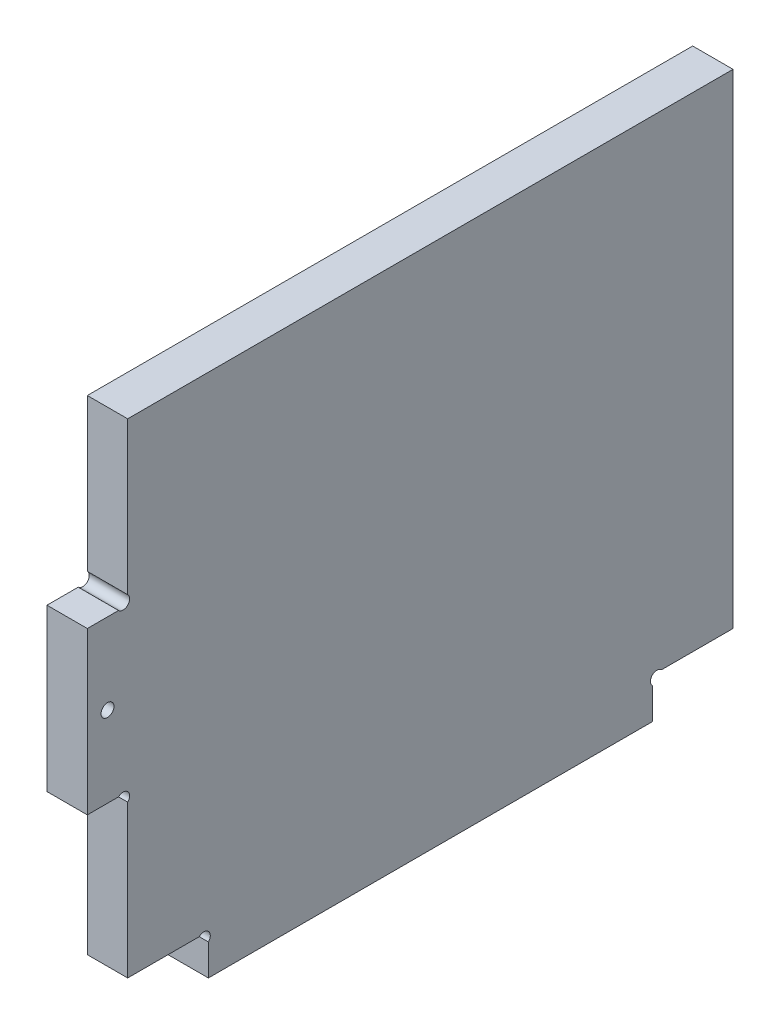
ISO-10303-21;
HEADER;
FILE_DESCRIPTION(('STEP AP214'),'2;1');
FILE_NAME('part.step','',(''),(''),'','','');
FILE_SCHEMA(('AUTOMOTIVE_DESIGN { 1 0 10303 214 1 1 1 1 }'));
ENDSEC;
DATA;
#1=APPLICATION_CONTEXT('core data for automotive mechanical design processes');
#2=APPLICATION_PROTOCOL_DEFINITION('international standard','automotive_design',2000,#1);
#3=PRODUCT_CONTEXT('',#1,'mechanical');
#4=PRODUCT('Part','Part','',(#3));
#5=PRODUCT_RELATED_PRODUCT_CATEGORY('part','',(#4));
#6=PRODUCT_DEFINITION_FORMATION('','',#4);
#7=PRODUCT_DEFINITION_CONTEXT('part definition',#1,'design');
#8=PRODUCT_DEFINITION('design','',#6,#7);
#9=PRODUCT_DEFINITION_SHAPE('','',#8);
#10=(LENGTH_UNIT() NAMED_UNIT(*) SI_UNIT(.MILLI.,.METRE.));
#11=(NAMED_UNIT(*) PLANE_ANGLE_UNIT() SI_UNIT($,.RADIAN.));
#12=(NAMED_UNIT(*) SI_UNIT($,.STERADIAN.) SOLID_ANGLE_UNIT());
#13=UNCERTAINTY_MEASURE_WITH_UNIT(LENGTH_MEASURE(1.E-05),#10,'distance_accuracy_value','');
#14=(GEOMETRIC_REPRESENTATION_CONTEXT(3) GLOBAL_UNCERTAINTY_ASSIGNED_CONTEXT((#13)) GLOBAL_UNIT_ASSIGNED_CONTEXT((#10,
#11,#12)) REPRESENTATION_CONTEXT('',''));
#15=CARTESIAN_POINT('',(0.,0.,0.));
#16=DIRECTION('',(0.,0.,1.));
#17=DIRECTION('',(1.,0.,0.));
#18=AXIS2_PLACEMENT_3D('',#15,#16,#17);
#19=CARTESIAN_POINT('',(10.,8.86862915010153,-141.131370849899));
#20=DIRECTION('',(1.,0.,0.));
#21=DIRECTION('',(0.,0.,-1.));
#22=AXIS2_PLACEMENT_3D('',#19,#20,#21);
#23=PLANE('',#22);
#24=CARTESIAN_POINT('',(10.,8.86862915010153,-141.131370849899));
#25=DIRECTION('',(-1.,0.,0.));
#26=DIRECTION('',(0.,0.,-1.));
#27=AXIS2_PLACEMENT_3D('',#24,#25,#26);
#28=CIRCLE('',#27,1.59999999999999);
#29=CARTESIAN_POINT('',(10.,7.73725830020309,-140.));
#30=VERTEX_POINT('',#29);
#31=CARTESIAN_POINT('',(10.,10.,-142.262741699797));
#32=VERTEX_POINT('',#31);
#33=EDGE_CURVE('E200',#30,#32,#28,.T.);
#34=ORIENTED_EDGE('',*,*,#33,.T.);
#35=DIRECTION('',(0.,0.,-1.));
#36=VECTOR('',#35,1.);
#37=CARTESIAN_POINT('',(10.,10.,-160.));
#38=LINE('',#37,#36);
#39=CARTESIAN_POINT('',(10.,10.,-160.));
#40=VERTEX_POINT('',#39);
#41=EDGE_CURVE('E161',#32,#40,#38,.T.);
#42=ORIENTED_EDGE('',*,*,#41,.T.);
#43=DIRECTION('',(0.,1.,0.));
#44=VECTOR('',#43,1.);
#45=CARTESIAN_POINT('',(10.,130.,-160.));
#46=LINE('',#45,#44);
#47=CARTESIAN_POINT('',(10.,130.,-160.));
#48=VERTEX_POINT('',#47);
#49=EDGE_CURVE('E203',#40,#48,#46,.T.);
#50=ORIENTED_EDGE('',*,*,#49,.T.);
#51=DIRECTION('',(0.,0.,1.));
#52=VECTOR('',#51,1.);
#53=CARTESIAN_POINT('',(10.,130.,-10.));
#54=LINE('',#53,#52);
#55=CARTESIAN_POINT('',(10.,130.,-10.));
#56=VERTEX_POINT('',#55);
#57=EDGE_CURVE('E205',#48,#56,#54,.T.);
#58=ORIENTED_EDGE('',*,*,#57,.T.);
#59=DIRECTION('',(0.,-1.,0.));
#60=VECTOR('',#59,1.);
#61=CARTESIAN_POINT('',(10.,92.262741699797,-10.));
#62=LINE('',#61,#60);
#63=CARTESIAN_POINT('',(10.,92.262741699797,-10.));
#64=VERTEX_POINT('',#63);
#65=EDGE_CURVE('E207',#56,#64,#62,.T.);
#66=ORIENTED_EDGE('',*,*,#65,.T.);
#67=CARTESIAN_POINT('',(10.,91.1313708498985,-8.86862915010154));
#68=DIRECTION('',(-1.,0.,0.));
#69=DIRECTION('',(0.,0.,1.));
#70=AXIS2_PLACEMENT_3D('',#67,#68,#69);
#71=CIRCLE('',#70,1.6);
#72=CARTESIAN_POINT('',(10.,90.,-7.73725830020305));
#73=VERTEX_POINT('',#72);
#74=EDGE_CURVE('E209',#64,#73,#71,.T.);
#75=ORIENTED_EDGE('',*,*,#74,.T.);
#76=DIRECTION('',(0.,0.,1.));
#77=VECTOR('',#76,1.);
#78=CARTESIAN_POINT('',(10.,90.,0.));
#79=LINE('',#78,#77);
#80=CARTESIAN_POINT('',(10.,90.,0.));
#81=VERTEX_POINT('',#80);
#82=EDGE_CURVE('E211',#73,#81,#79,.T.);
#83=ORIENTED_EDGE('',*,*,#82,.T.);
#84=DIRECTION('',(0.,-1.,0.));
#85=VECTOR('',#84,1.);
#86=CARTESIAN_POINT('',(10.,50.,0.));
#87=LINE('',#86,#85);
#88=CARTESIAN_POINT('',(10.,50.,0.));
#89=VERTEX_POINT('',#88);
#90=EDGE_CURVE('E213',#81,#89,#87,.T.);
#91=ORIENTED_EDGE('',*,*,#90,.T.);
#92=DIRECTION('',(0.,0.,-1.));
#93=VECTOR('',#92,1.);
#94=CARTESIAN_POINT('',(10.,50.,0.));
#95=LINE('',#94,#93);
#96=CARTESIAN_POINT('',(10.,50.,-7.73725830020305));
#97=VERTEX_POINT('',#96);
#98=EDGE_CURVE('E215',#89,#97,#95,.T.);
#99=ORIENTED_EDGE('',*,*,#98,.T.);
#100=CARTESIAN_POINT('',(10.,48.8686291501015,-8.86862915010154));
#101=DIRECTION('',(-1.,0.,0.));
#102=DIRECTION('',(0.,0.,-1.));
#103=AXIS2_PLACEMENT_3D('',#100,#101,#102);
#104=CIRCLE('',#103,1.6);
#105=CARTESIAN_POINT('',(10.,47.7372583002031,-10.));
#106=VERTEX_POINT('',#105);
#107=EDGE_CURVE('E217',#97,#106,#104,.T.);
#108=ORIENTED_EDGE('',*,*,#107,.T.);
#109=DIRECTION('',(0.,-1.,0.));
#110=VECTOR('',#109,1.);
#111=CARTESIAN_POINT('',(10.,10.,-10.));
#112=LINE('',#111,#110);
#113=CARTESIAN_POINT('',(10.,10.,-10.));
#114=VERTEX_POINT('',#113);
#115=EDGE_CURVE('E219',#106,#114,#112,.T.);
#116=ORIENTED_EDGE('',*,*,#115,.T.);
#117=DIRECTION('',(0.,0.,-1.));
#118=VECTOR('',#117,1.);
#119=CARTESIAN_POINT('',(10.,10.,-27.7372583002031));
#120=LINE('',#119,#118);
#121=CARTESIAN_POINT('',(10.,10.,-27.7372583002031));
#122=VERTEX_POINT('',#121);
#123=EDGE_CURVE('E221',#114,#122,#120,.T.);
#124=ORIENTED_EDGE('',*,*,#123,.T.);
#125=CARTESIAN_POINT('',(10.,8.86862915010153,-28.8686291501015));
#126=DIRECTION('',(-1.,0.,0.));
#127=DIRECTION('',(0.,0.,1.));
#128=AXIS2_PLACEMENT_3D('',#125,#126,#127);
#129=CIRCLE('',#128,1.59999999999999);
#130=CARTESIAN_POINT('',(10.,7.73725830020309,-30.));
#131=VERTEX_POINT('',#130);
#132=EDGE_CURVE('E223',#122,#131,#129,.T.);
#133=ORIENTED_EDGE('',*,*,#132,.T.);
#134=DIRECTION('',(0.,-1.,0.));
#135=VECTOR('',#134,1.);
#136=CARTESIAN_POINT('',(10.,7.73725830020309,-30.));
#137=LINE('',#136,#135);
#138=CARTESIAN_POINT('',(10.,0.,-30.));
#139=VERTEX_POINT('',#138);
#140=EDGE_CURVE('E225',#131,#139,#137,.T.);
#141=ORIENTED_EDGE('',*,*,#140,.T.);
#142=DIRECTION('',(0.,0.,-1.));
#143=VECTOR('',#142,1.);
#144=CARTESIAN_POINT('',(10.,0.,-30.));
#145=LINE('',#144,#143);
#146=CARTESIAN_POINT('',(10.,0.,-140.));
#147=VERTEX_POINT('',#146);
#148=EDGE_CURVE('E54',#139,#147,#145,.T.);
#149=ORIENTED_EDGE('',*,*,#148,.T.);
#150=DIRECTION('',(0.,1.,0.));
#151=VECTOR('',#150,1.);
#152=CARTESIAN_POINT('',(10.,7.73725830020309,-140.));
#153=LINE('',#152,#151);
#154=EDGE_CURVE('E49',#147,#30,#153,.T.);
#155=ORIENTED_EDGE('',*,*,#154,.T.);
#156=EDGE_LOOP('',(#34,#42,#50,#58,#66,#75,#83,#91,#99,#108,#116,#124,#133,#141,#149,#155));
#157=FACE_BOUND('',#156,.T.);
#158=CARTESIAN_POINT('',(10.,70.,-5.));
#159=DIRECTION('',(1.,0.,0.));
#160=DIRECTION('',(0.,0.,-1.));
#161=AXIS2_PLACEMENT_3D('',#158,#159,#160);
#162=CIRCLE('',#161,1.6);
#163=CARTESIAN_POINT('',(10.,70.,-6.6));
#164=VERTEX_POINT('',#163);
#165=EDGE_CURVE('E166',#164,#164,#162,.T.);
#166=ORIENTED_EDGE('',*,*,#165,.F.);
#167=EDGE_LOOP('',(#166));
#168=FACE_BOUND('',#167,.T.);
#169=ADVANCED_FACE('F34',(#157,#168),#23,.T.);
#170=CARTESIAN_POINT('',(0.,8.86862915010153,-141.131370849899));
#171=DIRECTION('',(1.,0.,0.));
#172=DIRECTION('',(0.,0.,-1.));
#173=AXIS2_PLACEMENT_3D('',#170,#171,#172);
#174=PLANE('',#173);
#175=CARTESIAN_POINT('',(0.,8.86862915010153,-141.131370849899));
#176=DIRECTION('',(-1.,0.,0.));
#177=DIRECTION('',(0.,0.,-1.));
#178=AXIS2_PLACEMENT_3D('',#175,#176,#177);
#179=CIRCLE('',#178,1.59999999999999);
#180=CARTESIAN_POINT('',(0.,7.73725830020309,-140.));
#181=VERTEX_POINT('',#180);
#182=CARTESIAN_POINT('',(0.,10.,-142.262741699797));
#183=VERTEX_POINT('',#182);
#184=EDGE_CURVE('E152',#181,#183,#179,.T.);
#185=ORIENTED_EDGE('',*,*,#184,.F.);
#186=DIRECTION('',(0.,1.,0.));
#187=VECTOR('',#186,1.);
#188=CARTESIAN_POINT('',(0.,7.73725830020309,-140.));
#189=LINE('',#188,#187);
#190=CARTESIAN_POINT('',(0.,0.,-140.));
#191=VERTEX_POINT('',#190);
#192=EDGE_CURVE('E198',#191,#181,#189,.T.);
#193=ORIENTED_EDGE('',*,*,#192,.F.);
#194=DIRECTION('',(0.,0.,-1.));
#195=VECTOR('',#194,1.);
#196=CARTESIAN_POINT('',(0.,0.,-30.));
#197=LINE('',#196,#195);
#198=CARTESIAN_POINT('',(0.,0.,-30.));
#199=VERTEX_POINT('',#198);
#200=EDGE_CURVE('E196',#199,#191,#197,.T.);
#201=ORIENTED_EDGE('',*,*,#200,.F.);
#202=DIRECTION('',(0.,-1.,0.));
#203=VECTOR('',#202,1.);
#204=CARTESIAN_POINT('',(0.,7.73725830020309,-30.));
#205=LINE('',#204,#203);
#206=CARTESIAN_POINT('',(0.,7.73725830020309,-30.));
#207=VERTEX_POINT('',#206);
#208=EDGE_CURVE('E194',#207,#199,#205,.T.);
#209=ORIENTED_EDGE('',*,*,#208,.F.);
#210=CARTESIAN_POINT('',(0.,8.86862915010153,-28.8686291501015));
#211=DIRECTION('',(-1.,0.,0.));
#212=DIRECTION('',(0.,0.,1.));
#213=AXIS2_PLACEMENT_3D('',#210,#211,#212);
#214=CIRCLE('',#213,1.59999999999999);
#215=CARTESIAN_POINT('',(0.,10.,-27.7372583002031));
#216=VERTEX_POINT('',#215);
#217=EDGE_CURVE('E192',#216,#207,#214,.T.);
#218=ORIENTED_EDGE('',*,*,#217,.F.);
#219=DIRECTION('',(0.,0.,-1.));
#220=VECTOR('',#219,1.);
#221=CARTESIAN_POINT('',(0.,10.,-27.7372583002031));
#222=LINE('',#221,#220);
#223=CARTESIAN_POINT('',(0.,10.,-10.));
#224=VERTEX_POINT('',#223);
#225=EDGE_CURVE('E190',#224,#216,#222,.T.);
#226=ORIENTED_EDGE('',*,*,#225,.F.);
#227=DIRECTION('',(0.,-1.,0.));
#228=VECTOR('',#227,1.);
#229=CARTESIAN_POINT('',(0.,10.,-10.));
#230=LINE('',#229,#228);
#231=CARTESIAN_POINT('',(0.,47.7372583002031,-10.));
#232=VERTEX_POINT('',#231);
#233=EDGE_CURVE('E188',#232,#224,#230,.T.);
#234=ORIENTED_EDGE('',*,*,#233,.F.);
#235=CARTESIAN_POINT('',(0.,48.8686291501015,-8.86862915010154));
#236=DIRECTION('',(-1.,0.,0.));
#237=DIRECTION('',(0.,0.,-1.));
#238=AXIS2_PLACEMENT_3D('',#235,#236,#237);
#239=CIRCLE('',#238,1.6);
#240=CARTESIAN_POINT('',(0.,50.,-7.73725830020305));
#241=VERTEX_POINT('',#240);
#242=EDGE_CURVE('E186',#241,#232,#239,.T.);
#243=ORIENTED_EDGE('',*,*,#242,.F.);
#244=DIRECTION('',(0.,0.,-1.));
#245=VECTOR('',#244,1.);
#246=CARTESIAN_POINT('',(0.,50.,0.));
#247=LINE('',#246,#245);
#248=CARTESIAN_POINT('',(0.,50.,0.));
#249=VERTEX_POINT('',#248);
#250=EDGE_CURVE('E184',#249,#241,#247,.T.);
#251=ORIENTED_EDGE('',*,*,#250,.F.);
#252=DIRECTION('',(0.,-1.,0.));
#253=VECTOR('',#252,1.);
#254=CARTESIAN_POINT('',(0.,50.,0.));
#255=LINE('',#254,#253);
#256=CARTESIAN_POINT('',(0.,90.,0.));
#257=VERTEX_POINT('',#256);
#258=EDGE_CURVE('E182',#257,#249,#255,.T.);
#259=ORIENTED_EDGE('',*,*,#258,.F.);
#260=DIRECTION('',(0.,0.,1.));
#261=VECTOR('',#260,1.);
#262=CARTESIAN_POINT('',(0.,90.,0.));
#263=LINE('',#262,#261);
#264=CARTESIAN_POINT('',(0.,90.,-7.73725830020305));
#265=VERTEX_POINT('',#264);
#266=EDGE_CURVE('E180',#265,#257,#263,.T.);
#267=ORIENTED_EDGE('',*,*,#266,.F.);
#268=CARTESIAN_POINT('',(0.,91.1313708498985,-8.86862915010154));
#269=DIRECTION('',(-1.,0.,0.));
#270=DIRECTION('',(0.,0.,1.));
#271=AXIS2_PLACEMENT_3D('',#268,#269,#270);
#272=CIRCLE('',#271,1.6);
#273=CARTESIAN_POINT('',(0.,92.262741699797,-10.));
#274=VERTEX_POINT('',#273);
#275=EDGE_CURVE('E178',#274,#265,#272,.T.);
#276=ORIENTED_EDGE('',*,*,#275,.F.);
#277=DIRECTION('',(0.,-1.,0.));
#278=VECTOR('',#277,1.);
#279=CARTESIAN_POINT('',(0.,92.262741699797,-10.));
#280=LINE('',#279,#278);
#281=CARTESIAN_POINT('',(0.,130.,-10.));
#282=VERTEX_POINT('',#281);
#283=EDGE_CURVE('E176',#282,#274,#280,.T.);
#284=ORIENTED_EDGE('',*,*,#283,.F.);
#285=DIRECTION('',(0.,0.,1.));
#286=VECTOR('',#285,1.);
#287=CARTESIAN_POINT('',(0.,130.,-10.));
#288=LINE('',#287,#286);
#289=CARTESIAN_POINT('',(0.,130.,-160.));
#290=VERTEX_POINT('',#289);
#291=EDGE_CURVE('E174',#290,#282,#288,.T.);
#292=ORIENTED_EDGE('',*,*,#291,.F.);
#293=DIRECTION('',(0.,1.,0.));
#294=VECTOR('',#293,1.);
#295=CARTESIAN_POINT('',(0.,130.,-160.));
#296=LINE('',#295,#294);
#297=CARTESIAN_POINT('',(0.,10.,-160.));
#298=VERTEX_POINT('',#297);
#299=EDGE_CURVE('E154',#298,#290,#296,.T.);
#300=ORIENTED_EDGE('',*,*,#299,.F.);
#301=DIRECTION('',(0.,0.,-1.));
#302=VECTOR('',#301,1.);
#303=CARTESIAN_POINT('',(0.,10.,-160.));
#304=LINE('',#303,#302);
#305=EDGE_CURVE('E147',#183,#298,#304,.T.);
#306=ORIENTED_EDGE('',*,*,#305,.F.);
#307=EDGE_LOOP('',(#185,#193,#201,#209,#218,#226,#234,#243,#251,#259,#267,#276,#284,#292,#300,#306));
#308=FACE_BOUND('',#307,.T.);
#309=CARTESIAN_POINT('',(0.,70.,-5.));
#310=DIRECTION('',(1.,0.,0.));
#311=DIRECTION('',(0.,0.,-1.));
#312=AXIS2_PLACEMENT_3D('',#309,#310,#311);
#313=CIRCLE('',#312,1.6);
#314=CARTESIAN_POINT('',(0.,70.,-6.6));
#315=VERTEX_POINT('',#314);
#316=EDGE_CURVE('E169',#315,#315,#313,.T.);
#317=ORIENTED_EDGE('',*,*,#316,.T.);
#318=EDGE_LOOP('',(#317));
#319=FACE_BOUND('',#318,.T.);
#320=ADVANCED_FACE('F148',(#308,#319),#174,.F.);
#321=CARTESIAN_POINT('',(10.,8.86862915010153,-141.131370849899));
#322=DIRECTION('',(-1.,0.,0.));
#323=DIRECTION('',(0.,0.,1.));
#324=AXIS2_PLACEMENT_3D('',#321,#322,#323);
#325=CYLINDRICAL_SURFACE('',#324,1.59999999999999);
#326=ORIENTED_EDGE('',*,*,#184,.T.);
#327=DIRECTION('',(-1.,0.,0.));
#328=VECTOR('',#327,1.);
#329=CARTESIAN_POINT('',(10.,10.,-142.262741699797));
#330=LINE('',#329,#328);
#331=EDGE_CURVE('E11',#32,#183,#330,.T.);
#332=ORIENTED_EDGE('',*,*,#331,.F.);
#333=ORIENTED_EDGE('',*,*,#33,.F.);
#334=DIRECTION('',(-1.,0.,0.));
#335=VECTOR('',#334,1.);
#336=CARTESIAN_POINT('',(10.,7.73725830020309,-140.));
#337=LINE('',#336,#335);
#338=EDGE_CURVE('E165',#30,#181,#337,.T.);
#339=ORIENTED_EDGE('',*,*,#338,.T.);
#340=EDGE_LOOP('',(#326,#332,#333,#339));
#341=FACE_BOUND('',#340,.T.);
#342=ADVANCED_FACE('F36',(#341),#325,.F.);
#343=CARTESIAN_POINT('',(10.,10.,-160.));
#344=DIRECTION('',(0.,1.,0.));
#345=DIRECTION('',(0.,0.,1.));
#346=AXIS2_PLACEMENT_3D('',#343,#344,#345);
#347=PLANE('',#346);
#348=ORIENTED_EDGE('',*,*,#305,.T.);
#349=DIRECTION('',(-1.,0.,0.));
#350=VECTOR('',#349,1.);
#351=CARTESIAN_POINT('',(10.,10.,-160.));
#352=LINE('',#351,#350);
#353=EDGE_CURVE('E42',#40,#298,#352,.T.);
#354=ORIENTED_EDGE('',*,*,#353,.F.);
#355=ORIENTED_EDGE('',*,*,#41,.F.);
#356=ORIENTED_EDGE('',*,*,#331,.T.);
#357=EDGE_LOOP('',(#348,#354,#355,#356));
#358=FACE_BOUND('',#357,.T.);
#359=ADVANCED_FACE('F160',(#358),#347,.F.);
#360=CARTESIAN_POINT('',(10.,130.,-160.));
#361=DIRECTION('',(0.,0.,1.));
#362=DIRECTION('',(1.,0.,0.));
#363=AXIS2_PLACEMENT_3D('',#360,#361,#362);
#364=PLANE('',#363);
#365=ORIENTED_EDGE('',*,*,#299,.T.);
#366=DIRECTION('',(-1.,0.,0.));
#367=VECTOR('',#366,1.);
#368=CARTESIAN_POINT('',(10.,130.,-160.));
#369=LINE('',#368,#367);
#370=EDGE_CURVE('E266',#48,#290,#369,.T.);
#371=ORIENTED_EDGE('',*,*,#370,.F.);
#372=ORIENTED_EDGE('',*,*,#49,.F.);
#373=ORIENTED_EDGE('',*,*,#353,.T.);
#374=EDGE_LOOP('',(#365,#371,#372,#373));
#375=FACE_BOUND('',#374,.T.);
#376=ADVANCED_FACE('F270',(#375),#364,.F.);
#377=CARTESIAN_POINT('',(10.,130.,-10.));
#378=DIRECTION('',(0.,-1.,0.));
#379=DIRECTION('',(0.,0.,-1.));
#380=AXIS2_PLACEMENT_3D('',#377,#378,#379);
#381=PLANE('',#380);
#382=ORIENTED_EDGE('',*,*,#291,.T.);
#383=DIRECTION('',(-1.,0.,0.));
#384=VECTOR('',#383,1.);
#385=CARTESIAN_POINT('',(10.,130.,-10.));
#386=LINE('',#385,#384);
#387=EDGE_CURVE('E263',#56,#282,#386,.T.);
#388=ORIENTED_EDGE('',*,*,#387,.F.);
#389=ORIENTED_EDGE('',*,*,#57,.F.);
#390=ORIENTED_EDGE('',*,*,#370,.T.);
#391=EDGE_LOOP('',(#382,#388,#389,#390));
#392=FACE_BOUND('',#391,.T.);
#393=ADVANCED_FACE('F278',(#392),#381,.F.);
#394=CARTESIAN_POINT('',(10.,92.262741699797,-10.));
#395=DIRECTION('',(0.,0.,-1.));
#396=DIRECTION('',(0.,1.,0.));
#397=AXIS2_PLACEMENT_3D('',#394,#395,#396);
#398=PLANE('',#397);
#399=ORIENTED_EDGE('',*,*,#283,.T.);
#400=DIRECTION('',(-1.,0.,0.));
#401=VECTOR('',#400,1.);
#402=CARTESIAN_POINT('',(10.,92.262741699797,-10.));
#403=LINE('',#402,#401);
#404=EDGE_CURVE('E260',#64,#274,#403,.T.);
#405=ORIENTED_EDGE('',*,*,#404,.F.);
#406=ORIENTED_EDGE('',*,*,#65,.F.);
#407=ORIENTED_EDGE('',*,*,#387,.T.);
#408=EDGE_LOOP('',(#399,#405,#406,#407));
#409=FACE_BOUND('',#408,.T.);
#410=ADVANCED_FACE('F281',(#409),#398,.F.);
#411=CARTESIAN_POINT('',(10.,91.1313708498985,-8.86862915010154));
#412=DIRECTION('',(-1.,0.,0.));
#413=DIRECTION('',(0.,0.,1.));
#414=AXIS2_PLACEMENT_3D('',#411,#412,#413);
#415=CYLINDRICAL_SURFACE('',#414,1.6);
#416=ORIENTED_EDGE('',*,*,#275,.T.);
#417=DIRECTION('',(-1.,0.,0.));
#418=VECTOR('',#417,1.);
#419=CARTESIAN_POINT('',(10.,90.,-7.73725830020305));
#420=LINE('',#419,#418);
#421=EDGE_CURVE('E257',#73,#265,#420,.T.);
#422=ORIENTED_EDGE('',*,*,#421,.F.);
#423=ORIENTED_EDGE('',*,*,#74,.F.);
#424=ORIENTED_EDGE('',*,*,#404,.T.);
#425=EDGE_LOOP('',(#416,#422,#423,#424));
#426=FACE_BOUND('',#425,.T.);
#427=ADVANCED_FACE('F286',(#426),#415,.F.);
#428=CARTESIAN_POINT('',(10.,90.,0.));
#429=DIRECTION('',(0.,-1.,0.));
#430=DIRECTION('',(0.,0.,-1.));
#431=AXIS2_PLACEMENT_3D('',#428,#429,#430);
#432=PLANE('',#431);
#433=ORIENTED_EDGE('',*,*,#266,.T.);
#434=DIRECTION('',(-1.,0.,0.));
#435=VECTOR('',#434,1.);
#436=CARTESIAN_POINT('',(10.,90.,0.));
#437=LINE('',#436,#435);
#438=EDGE_CURVE('E254',#81,#257,#437,.T.);
#439=ORIENTED_EDGE('',*,*,#438,.F.);
#440=ORIENTED_EDGE('',*,*,#82,.F.);
#441=ORIENTED_EDGE('',*,*,#421,.T.);
#442=EDGE_LOOP('',(#433,#439,#440,#441));
#443=FACE_BOUND('',#442,.T.);
#444=ADVANCED_FACE('F292',(#443),#432,.F.);
#445=CARTESIAN_POINT('',(10.,50.,0.));
#446=DIRECTION('',(0.,0.,-1.));
#447=DIRECTION('',(-1.,0.,0.));
#448=AXIS2_PLACEMENT_3D('',#445,#446,#447);
#449=PLANE('',#448);
#450=ORIENTED_EDGE('',*,*,#258,.T.);
#451=DIRECTION('',(-1.,0.,0.));
#452=VECTOR('',#451,1.);
#453=CARTESIAN_POINT('',(10.,50.,0.));
#454=LINE('',#453,#452);
#455=EDGE_CURVE('E251',#89,#249,#454,.T.);
#456=ORIENTED_EDGE('',*,*,#455,.F.);
#457=ORIENTED_EDGE('',*,*,#90,.F.);
#458=ORIENTED_EDGE('',*,*,#438,.T.);
#459=EDGE_LOOP('',(#450,#456,#457,#458));
#460=FACE_BOUND('',#459,.T.);
#461=ADVANCED_FACE('F296',(#460),#449,.F.);
#462=CARTESIAN_POINT('',(10.,50.,0.));
#463=DIRECTION('',(0.,1.,0.));
#464=DIRECTION('',(0.,0.,1.));
#465=AXIS2_PLACEMENT_3D('',#462,#463,#464);
#466=PLANE('',#465);
#467=ORIENTED_EDGE('',*,*,#250,.T.);
#468=DIRECTION('',(-1.,0.,0.));
#469=VECTOR('',#468,1.);
#470=CARTESIAN_POINT('',(10.,50.,-7.73725830020305));
#471=LINE('',#470,#469);
#472=EDGE_CURVE('E248',#97,#241,#471,.T.);
#473=ORIENTED_EDGE('',*,*,#472,.F.);
#474=ORIENTED_EDGE('',*,*,#98,.F.);
#475=ORIENTED_EDGE('',*,*,#455,.T.);
#476=EDGE_LOOP('',(#467,#473,#474,#475));
#477=FACE_BOUND('',#476,.T.);
#478=ADVANCED_FACE('F301',(#477),#466,.F.);
#479=CARTESIAN_POINT('',(10.,48.8686291501015,-8.86862915010154));
#480=DIRECTION('',(-1.,0.,0.));
#481=DIRECTION('',(0.,0.,1.));
#482=AXIS2_PLACEMENT_3D('',#479,#480,#481);
#483=CYLINDRICAL_SURFACE('',#482,1.6);
#484=ORIENTED_EDGE('',*,*,#242,.T.);
#485=DIRECTION('',(-1.,0.,0.));
#486=VECTOR('',#485,1.);
#487=CARTESIAN_POINT('',(10.,47.7372583002031,-10.));
#488=LINE('',#487,#486);
#489=EDGE_CURVE('E245',#106,#232,#488,.T.);
#490=ORIENTED_EDGE('',*,*,#489,.F.);
#491=ORIENTED_EDGE('',*,*,#107,.F.);
#492=ORIENTED_EDGE('',*,*,#472,.T.);
#493=EDGE_LOOP('',(#484,#490,#491,#492));
#494=FACE_BOUND('',#493,.T.);
#495=ADVANCED_FACE('F307',(#494),#483,.F.);
#496=CARTESIAN_POINT('',(10.,10.,-10.));
#497=DIRECTION('',(0.,0.,-1.));
#498=DIRECTION('',(0.,1.,0.));
#499=AXIS2_PLACEMENT_3D('',#496,#497,#498);
#500=PLANE('',#499);
#501=ORIENTED_EDGE('',*,*,#233,.T.);
#502=DIRECTION('',(-1.,0.,0.));
#503=VECTOR('',#502,1.);
#504=CARTESIAN_POINT('',(10.,10.,-10.));
#505=LINE('',#504,#503);
#506=EDGE_CURVE('E242',#114,#224,#505,.T.);
#507=ORIENTED_EDGE('',*,*,#506,.F.);
#508=ORIENTED_EDGE('',*,*,#115,.F.);
#509=ORIENTED_EDGE('',*,*,#489,.T.);
#510=EDGE_LOOP('',(#501,#507,#508,#509));
#511=FACE_BOUND('',#510,.T.);
#512=ADVANCED_FACE('F311',(#511),#500,.F.);
#513=CARTESIAN_POINT('',(10.,10.,-27.7372583002031));
#514=DIRECTION('',(0.,1.,0.));
#515=DIRECTION('',(0.,0.,1.));
#516=AXIS2_PLACEMENT_3D('',#513,#514,#515);
#517=PLANE('',#516);
#518=ORIENTED_EDGE('',*,*,#225,.T.);
#519=DIRECTION('',(-1.,0.,0.));
#520=VECTOR('',#519,1.);
#521=CARTESIAN_POINT('',(10.,10.,-27.7372583002031));
#522=LINE('',#521,#520);
#523=EDGE_CURVE('E239',#122,#216,#522,.T.);
#524=ORIENTED_EDGE('',*,*,#523,.F.);
#525=ORIENTED_EDGE('',*,*,#123,.F.);
#526=ORIENTED_EDGE('',*,*,#506,.T.);
#527=EDGE_LOOP('',(#518,#524,#525,#526));
#528=FACE_BOUND('',#527,.T.);
#529=ADVANCED_FACE('F316',(#528),#517,.F.);
#530=CARTESIAN_POINT('',(10.,8.86862915010153,-28.8686291501015));
#531=DIRECTION('',(-1.,0.,0.));
#532=DIRECTION('',(0.,0.,1.));
#533=AXIS2_PLACEMENT_3D('',#530,#531,#532);
#534=CYLINDRICAL_SURFACE('',#533,1.59999999999999);
#535=ORIENTED_EDGE('',*,*,#217,.T.);
#536=DIRECTION('',(-1.,0.,0.));
#537=VECTOR('',#536,1.);
#538=CARTESIAN_POINT('',(10.,7.73725830020309,-30.));
#539=LINE('',#538,#537);
#540=EDGE_CURVE('E236',#131,#207,#539,.T.);
#541=ORIENTED_EDGE('',*,*,#540,.F.);
#542=ORIENTED_EDGE('',*,*,#132,.F.);
#543=ORIENTED_EDGE('',*,*,#523,.T.);
#544=EDGE_LOOP('',(#535,#541,#542,#543));
#545=FACE_BOUND('',#544,.T.);
#546=ADVANCED_FACE('F322',(#545),#534,.F.);
#547=CARTESIAN_POINT('',(10.,7.73725830020309,-30.));
#548=DIRECTION('',(0.,0.,-1.));
#549=DIRECTION('',(-1.,0.,0.));
#550=AXIS2_PLACEMENT_3D('',#547,#548,#549);
#551=PLANE('',#550);
#552=ORIENTED_EDGE('',*,*,#208,.T.);
#553=DIRECTION('',(-1.,0.,0.));
#554=VECTOR('',#553,1.);
#555=CARTESIAN_POINT('',(10.,0.,-30.));
#556=LINE('',#555,#554);
#557=EDGE_CURVE('E233',#139,#199,#556,.T.);
#558=ORIENTED_EDGE('',*,*,#557,.F.);
#559=ORIENTED_EDGE('',*,*,#140,.F.);
#560=ORIENTED_EDGE('',*,*,#540,.T.);
#561=EDGE_LOOP('',(#552,#558,#559,#560));
#562=FACE_BOUND('',#561,.T.);
#563=ADVANCED_FACE('F326',(#562),#551,.F.);
#564=CARTESIAN_POINT('',(10.,0.,-30.));
#565=DIRECTION('',(0.,1.,0.));
#566=DIRECTION('',(0.,0.,1.));
#567=AXIS2_PLACEMENT_3D('',#564,#565,#566);
#568=PLANE('',#567);
#569=ORIENTED_EDGE('',*,*,#200,.T.);
#570=DIRECTION('',(-1.,0.,0.));
#571=VECTOR('',#570,1.);
#572=CARTESIAN_POINT('',(10.,0.,-140.));
#573=LINE('',#572,#571);
#574=EDGE_CURVE('E230',#147,#191,#573,.T.);
#575=ORIENTED_EDGE('',*,*,#574,.F.);
#576=ORIENTED_EDGE('',*,*,#148,.F.);
#577=ORIENTED_EDGE('',*,*,#557,.T.);
#578=EDGE_LOOP('',(#569,#575,#576,#577));
#579=FACE_BOUND('',#578,.T.);
#580=ADVANCED_FACE('F329',(#579),#568,.F.);
#581=CARTESIAN_POINT('',(10.,7.73725830020309,-140.));
#582=DIRECTION('',(0.,0.,1.));
#583=DIRECTION('',(1.,0.,0.));
#584=AXIS2_PLACEMENT_3D('',#581,#582,#583);
#585=PLANE('',#584);
#586=ORIENTED_EDGE('',*,*,#192,.T.);
#587=ORIENTED_EDGE('',*,*,#338,.F.);
#588=ORIENTED_EDGE('',*,*,#154,.F.);
#589=ORIENTED_EDGE('',*,*,#574,.T.);
#590=EDGE_LOOP('',(#586,#587,#588,#589));
#591=FACE_BOUND('',#590,.T.);
#592=ADVANCED_FACE('F331',(#591),#585,.F.);
#593=CARTESIAN_POINT('',(10.,70.,-5.));
#594=DIRECTION('',(-1.,0.,0.));
#595=DIRECTION('',(0.,0.,1.));
#596=AXIS2_PLACEMENT_3D('',#593,#594,#595);
#597=CYLINDRICAL_SURFACE('',#596,1.6);
#598=ORIENTED_EDGE('',*,*,#165,.T.);
#599=EDGE_LOOP('',(#598));
#600=FACE_BOUND('',#599,.T.);
#601=ORIENTED_EDGE('',*,*,#316,.F.);
#602=EDGE_LOOP('',(#601));
#603=FACE_BOUND('',#602,.T.);
#604=ADVANCED_FACE('F333',(#600,#603),#597,.F.);
#605=CLOSED_SHELL('',(#169,#320,#342,#359,#376,#393,#410,#427,#444,#461,#478,#495,#512,#529,
#546,#563,#580,#592,#604));
#606=MANIFOLD_SOLID_BREP('B2',#605);
#607=ADVANCED_BREP_SHAPE_REPRESENTATION('',(#18,#606),#14);
#608=SHAPE_DEFINITION_REPRESENTATION(#9,#607);
ENDSEC;
END-ISO-10303-21;
